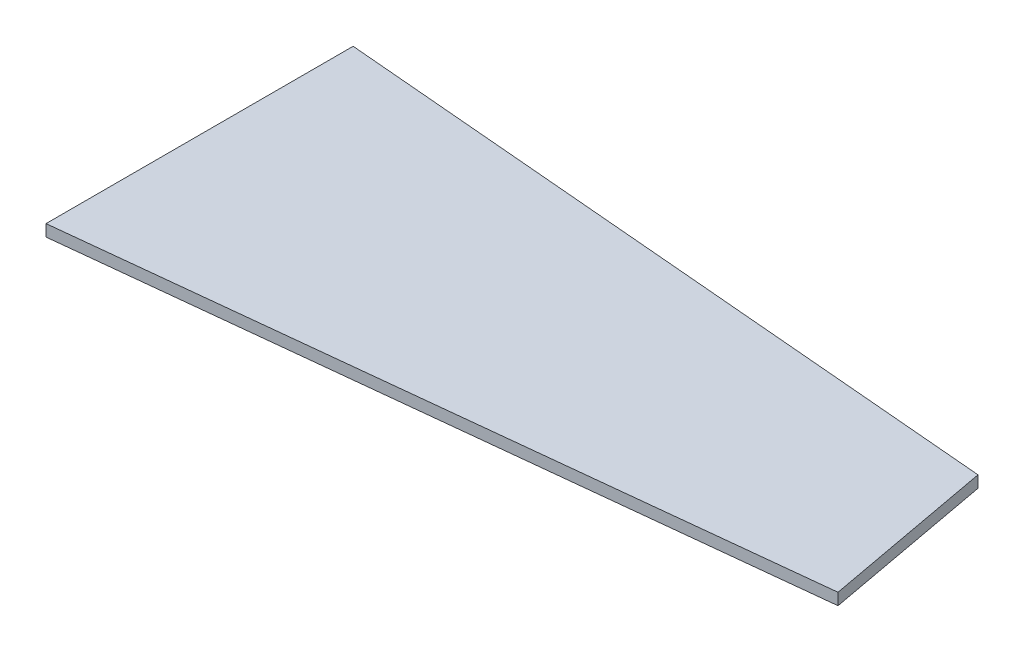
ISO-10303-21;
HEADER;
FILE_DESCRIPTION(('STEP AP214'),'2;1');
FILE_NAME('part.step','',(''),(''),'','','');
FILE_SCHEMA(('AUTOMOTIVE_DESIGN { 1 0 10303 214 1 1 1 1 }'));
ENDSEC;
DATA;
#1=APPLICATION_CONTEXT('core data for automotive mechanical design processes');
#2=APPLICATION_PROTOCOL_DEFINITION('international standard','automotive_design',2000,#1);
#3=PRODUCT_CONTEXT('',#1,'mechanical');
#4=PRODUCT('Part','Part','',(#3));
#5=PRODUCT_RELATED_PRODUCT_CATEGORY('part','',(#4));
#6=PRODUCT_DEFINITION_FORMATION('','',#4);
#7=PRODUCT_DEFINITION_CONTEXT('part definition',#1,'design');
#8=PRODUCT_DEFINITION('design','',#6,#7);
#9=PRODUCT_DEFINITION_SHAPE('','',#8);
#10=(LENGTH_UNIT() NAMED_UNIT(*) SI_UNIT(.MILLI.,.METRE.));
#11=(NAMED_UNIT(*) PLANE_ANGLE_UNIT() SI_UNIT($,.RADIAN.));
#12=(NAMED_UNIT(*) SI_UNIT($,.STERADIAN.) SOLID_ANGLE_UNIT());
#13=UNCERTAINTY_MEASURE_WITH_UNIT(LENGTH_MEASURE(1.E-05),#10,'distance_accuracy_value','');
#14=(GEOMETRIC_REPRESENTATION_CONTEXT(3) GLOBAL_UNCERTAINTY_ASSIGNED_CONTEXT((#13)) GLOBAL_UNIT_ASSIGNED_CONTEXT((#10,
#11,#12)) REPRESENTATION_CONTEXT('',''));
#15=CARTESIAN_POINT('',(0.,0.,0.));
#16=DIRECTION('',(0.,0.,1.));
#17=DIRECTION('',(1.,0.,0.));
#18=AXIS2_PLACEMENT_3D('',#15,#16,#17);
#19=CARTESIAN_POINT('',(122.540188294609,2.,-13.1471259868002));
#20=DIRECTION('',(-0.983357622254099,0.,0.181680452318805));
#21=DIRECTION('',(0.181680452318805,0.,0.983357622254099));
#22=AXIS2_PLACEMENT_3D('',#19,#20,#21);
#23=PLANE('',#22);
#24=DIRECTION('',(-0.181680452318805,0.,-0.983357622254099));
#25=VECTOR('',#24,1.);
#26=CARTESIAN_POINT('',(122.540188294609,0.,-13.1471259868002));
#27=LINE('',#26,#25);
#28=CARTESIAN_POINT('',(122.540188294609,0.,-13.1471259868002));
#29=VERTEX_POINT('',#28);
#30=CARTESIAN_POINT('',(117.105263204049,0.,-42.5640222239546));
#31=VERTEX_POINT('',#30);
#32=EDGE_CURVE('E107',#29,#31,#27,.T.);
#33=ORIENTED_EDGE('',*,*,#32,.T.);
#34=DIRECTION('',(0.,-1.,0.));
#35=VECTOR('',#34,1.);
#36=CARTESIAN_POINT('',(117.105263204049,2.,-42.5640222239546));
#37=LINE('',#36,#35);
#38=CARTESIAN_POINT('',(117.105263204049,2.,-42.5640222239546));
#39=VERTEX_POINT('',#38);
#40=EDGE_CURVE('E11',#39,#31,#37,.T.);
#41=ORIENTED_EDGE('',*,*,#40,.F.);
#42=DIRECTION('',(-0.181680452318805,0.,-0.983357622254099));
#43=VECTOR('',#42,1.);
#44=CARTESIAN_POINT('',(122.540188294609,2.,-13.1471259868002));
#45=LINE('',#44,#43);
#46=CARTESIAN_POINT('',(122.540188294609,2.,-13.1471259868002));
#47=VERTEX_POINT('',#46);
#48=EDGE_CURVE('E91',#47,#39,#45,.T.);
#49=ORIENTED_EDGE('',*,*,#48,.F.);
#50=DIRECTION('',(0.,-1.,0.));
#51=VECTOR('',#50,1.);
#52=CARTESIAN_POINT('',(122.540188294609,2.,-13.1471259868002));
#53=LINE('',#52,#51);
#54=EDGE_CURVE('E103',#47,#29,#53,.T.);
#55=ORIENTED_EDGE('',*,*,#54,.T.);
#56=EDGE_LOOP('',(#33,#41,#49,#55));
#57=FACE_BOUND('',#56,.T.);
#58=ADVANCED_FACE('F39',(#57),#23,.F.);
#59=CARTESIAN_POINT('',(117.105263204049,2.,-42.5640222239546));
#60=DIRECTION('',(-0.0855479037086043,0.,0.996334058522072));
#61=DIRECTION('',(0.996334058522072,0.,0.0855479037086043));
#62=AXIS2_PLACEMENT_3D('',#59,#60,#61);
#63=PLANE('',#62);
#64=DIRECTION('',(-0.996334058522072,0.,-0.0855479037086043));
#65=VECTOR('',#64,1.);
#66=CARTESIAN_POINT('',(117.105263204049,0.,-42.5640222239546));
#67=LINE('',#66,#65);
#68=CARTESIAN_POINT('',(0.,0.,-52.6189929385072));
#69=VERTEX_POINT('',#68);
#70=EDGE_CURVE('E96',#31,#69,#67,.T.);
#71=ORIENTED_EDGE('',*,*,#70,.T.);
#72=DIRECTION('',(0.,-1.,0.));
#73=VECTOR('',#72,1.);
#74=CARTESIAN_POINT('',(0.,2.,-52.6189929385072));
#75=LINE('',#74,#73);
#76=CARTESIAN_POINT('',(0.,2.,-52.6189929385072));
#77=VERTEX_POINT('',#76);
#78=EDGE_CURVE('E48',#77,#69,#75,.T.);
#79=ORIENTED_EDGE('',*,*,#78,.F.);
#80=DIRECTION('',(-0.996334058522072,0.,-0.0855479037086043));
#81=VECTOR('',#80,1.);
#82=CARTESIAN_POINT('',(117.105263204049,2.,-42.5640222239546));
#83=LINE('',#82,#81);
#84=EDGE_CURVE('E86',#39,#77,#83,.T.);
#85=ORIENTED_EDGE('',*,*,#84,.F.);
#86=ORIENTED_EDGE('',*,*,#40,.T.);
#87=EDGE_LOOP('',(#71,#79,#85,#86));
#88=FACE_BOUND('',#87,.T.);
#89=ADVANCED_FACE('F95',(#88),#63,.F.);
#90=CARTESIAN_POINT('',(0.,2.,-52.6189929385072));
#91=DIRECTION('',(1.,0.,0.));
#92=DIRECTION('',(0.,0.,-1.));
#93=AXIS2_PLACEMENT_3D('',#90,#91,#92);
#94=PLANE('',#93);
#95=DIRECTION('',(0.,0.,1.));
#96=VECTOR('',#95,1.);
#97=CARTESIAN_POINT('',(0.,0.,-52.6189929385072));
#98=LINE('',#97,#96);
#99=CARTESIAN_POINT('',(0.,0.,0.));
#100=VERTEX_POINT('',#99);
#101=EDGE_CURVE('E73',#69,#100,#98,.T.);
#102=ORIENTED_EDGE('',*,*,#101,.T.);
#103=DIRECTION('',(0.,-1.,0.));
#104=VECTOR('',#103,1.);
#105=CARTESIAN_POINT('',(0.,2.,0.));
#106=LINE('',#105,#104);
#107=CARTESIAN_POINT('',(0.,2.,0.));
#108=VERTEX_POINT('',#107);
#109=EDGE_CURVE('E98',#108,#100,#106,.T.);
#110=ORIENTED_EDGE('',*,*,#109,.F.);
#111=DIRECTION('',(0.,0.,1.));
#112=VECTOR('',#111,1.);
#113=CARTESIAN_POINT('',(0.,2.,-52.6189929385072));
#114=LINE('',#113,#112);
#115=EDGE_CURVE('E89',#77,#108,#114,.T.);
#116=ORIENTED_EDGE('',*,*,#115,.F.);
#117=ORIENTED_EDGE('',*,*,#78,.T.);
#118=EDGE_LOOP('',(#102,#110,#116,#117));
#119=FACE_BOUND('',#118,.T.);
#120=ADVANCED_FACE('F99',(#119),#94,.F.);
#121=CARTESIAN_POINT('',(0.,2.,0.));
#122=DIRECTION('',(-0.106676074181004,0.,-0.99429382739577));
#123=DIRECTION('',(-0.99429382739577,0.,0.106676074181004));
#124=AXIS2_PLACEMENT_3D('',#121,#122,#123);
#125=PLANE('',#124);
#126=DIRECTION('',(0.99429382739577,0.,-0.106676074181004));
#127=VECTOR('',#126,1.);
#128=CARTESIAN_POINT('',(0.,0.,0.));
#129=LINE('',#128,#127);
#130=EDGE_CURVE('E79',#100,#29,#129,.T.);
#131=ORIENTED_EDGE('',*,*,#130,.T.);
#132=ORIENTED_EDGE('',*,*,#54,.F.);
#133=DIRECTION('',(0.99429382739577,0.,-0.106676074181004));
#134=VECTOR('',#133,1.);
#135=CARTESIAN_POINT('',(0.,2.,0.));
#136=LINE('',#135,#134);
#137=EDGE_CURVE('E56',#108,#47,#136,.T.);
#138=ORIENTED_EDGE('',*,*,#137,.F.);
#139=ORIENTED_EDGE('',*,*,#109,.T.);
#140=EDGE_LOOP('',(#131,#132,#138,#139));
#141=FACE_BOUND('',#140,.T.);
#142=ADVANCED_FACE('F120',(#141),#125,.F.);
#143=CARTESIAN_POINT('',(0.,2.,0.));
#144=DIRECTION('',(0.,-1.,0.));
#145=DIRECTION('',(0.,0.,-1.));
#146=AXIS2_PLACEMENT_3D('',#143,#144,#145);
#147=PLANE('',#146);
#148=ORIENTED_EDGE('',*,*,#48,.T.);
#149=ORIENTED_EDGE('',*,*,#84,.T.);
#150=ORIENTED_EDGE('',*,*,#115,.T.);
#151=ORIENTED_EDGE('',*,*,#137,.T.);
#152=EDGE_LOOP('',(#148,#149,#150,#151));
#153=FACE_BOUND('',#152,.T.);
#154=ADVANCED_FACE('F87',(#153),#147,.F.);
#155=CARTESIAN_POINT('',(0.,0.,0.));
#156=DIRECTION('',(0.,-1.,0.));
#157=DIRECTION('',(0.,0.,-1.));
#158=AXIS2_PLACEMENT_3D('',#155,#156,#157);
#159=PLANE('',#158);
#160=ORIENTED_EDGE('',*,*,#32,.F.);
#161=ORIENTED_EDGE('',*,*,#130,.F.);
#162=ORIENTED_EDGE('',*,*,#101,.F.);
#163=ORIENTED_EDGE('',*,*,#70,.F.);
#164=EDGE_LOOP('',(#160,#161,#162,#163));
#165=FACE_BOUND('',#164,.T.);
#166=ADVANCED_FACE('F123',(#165),#159,.T.);
#167=CLOSED_SHELL('',(#58,#89,#120,#142,#154,#166));
#168=MANIFOLD_SOLID_BREP('B2',#167);
#169=ADVANCED_BREP_SHAPE_REPRESENTATION('',(#18,#168),#14);
#170=SHAPE_DEFINITION_REPRESENTATION(#9,#169);
ENDSEC;
END-ISO-10303-21;
